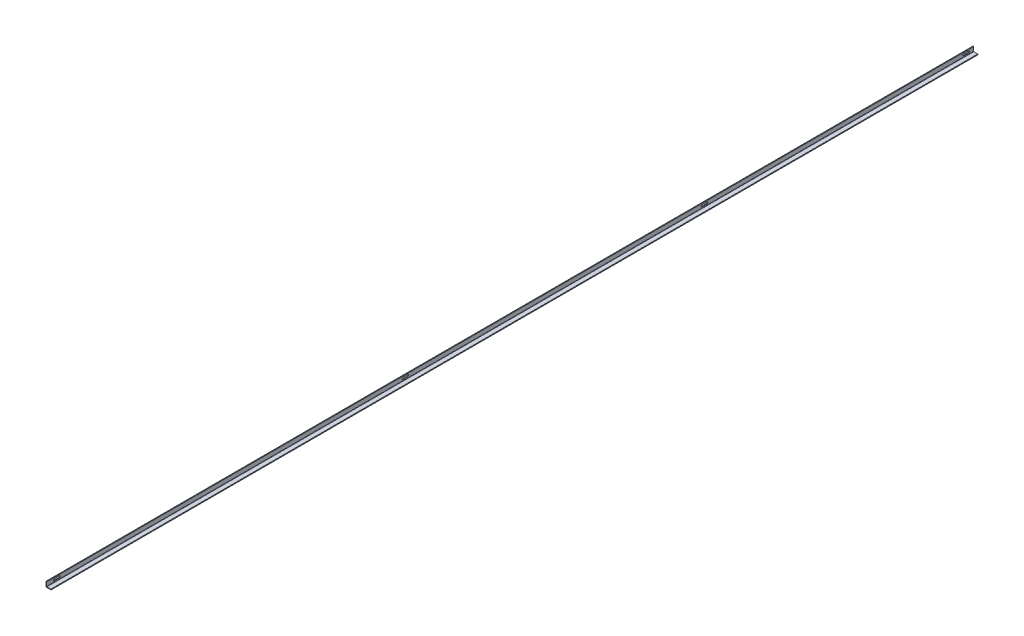
ISO-10303-21;
HEADER;
FILE_DESCRIPTION(('STEP AP214'),'2;1');
FILE_NAME('part.step','',(''),(''),'','','');
FILE_SCHEMA(('AUTOMOTIVE_DESIGN { 1 0 10303 214 1 1 1 1 }'));
ENDSEC;
DATA;
#1=APPLICATION_CONTEXT('core data for automotive mechanical design processes');
#2=APPLICATION_PROTOCOL_DEFINITION('international standard','automotive_design',2000,#1);
#3=PRODUCT_CONTEXT('',#1,'mechanical');
#4=PRODUCT('Part','Part','',(#3));
#5=PRODUCT_RELATED_PRODUCT_CATEGORY('part','',(#4));
#6=PRODUCT_DEFINITION_FORMATION('','',#4);
#7=PRODUCT_DEFINITION_CONTEXT('part definition',#1,'design');
#8=PRODUCT_DEFINITION('design','',#6,#7);
#9=PRODUCT_DEFINITION_SHAPE('','',#8);
#10=(LENGTH_UNIT() NAMED_UNIT(*) SI_UNIT(.MILLI.,.METRE.));
#11=(NAMED_UNIT(*) PLANE_ANGLE_UNIT() SI_UNIT($,.RADIAN.));
#12=(NAMED_UNIT(*) SI_UNIT($,.STERADIAN.) SOLID_ANGLE_UNIT());
#13=UNCERTAINTY_MEASURE_WITH_UNIT(LENGTH_MEASURE(1.E-05),#10,'distance_accuracy_value','');
#14=(GEOMETRIC_REPRESENTATION_CONTEXT(3) GLOBAL_UNCERTAINTY_ASSIGNED_CONTEXT((#13)) GLOBAL_UNIT_ASSIGNED_CONTEXT((#10,
#11,#12)) REPRESENTATION_CONTEXT('',''));
#15=CARTESIAN_POINT('',(0.,0.,0.));
#16=DIRECTION('',(0.,0.,1.));
#17=DIRECTION('',(1.,0.,0.));
#18=AXIS2_PLACEMENT_3D('',#15,#16,#17);
#19=CARTESIAN_POINT('',(3.175,0.,4660.9));
#20=DIRECTION('',(-1.,0.,0.));
#21=DIRECTION('',(0.,0.,1.));
#22=AXIS2_PLACEMENT_3D('',#19,#20,#21);
#23=PLANE('',#22);
#24=DIRECTION('',(0.,0.,1.));
#25=VECTOR('',#24,1.);
#26=CARTESIAN_POINT('',(3.175,9.9314,4597.4));
#27=LINE('',#26,#25);
#28=CARTESIAN_POINT('',(3.175,9.9314,4597.4));
#29=VERTEX_POINT('',#28);
#30=CARTESIAN_POINT('',(3.175,9.9314,4622.8));
#31=VERTEX_POINT('',#30);
#32=EDGE_CURVE('E200',#29,#31,#27,.T.);
#33=ORIENTED_EDGE('',*,*,#32,.T.);
#34=CARTESIAN_POINT('',(3.175,14.2875,4622.8));
#35=DIRECTION('',(1.,0.,0.));
#36=DIRECTION('',(0.,0.,-1.));
#37=AXIS2_PLACEMENT_3D('',#34,#35,#36);
#38=CIRCLE('',#37,4.3561);
#39=CARTESIAN_POINT('',(3.175,18.6436,4622.8));
#40=VERTEX_POINT('',#39);
#41=EDGE_CURVE('E47',#40,#31,#38,.T.);
#42=ORIENTED_EDGE('',*,*,#41,.F.);
#43=DIRECTION('',(0.,0.,-1.));
#44=VECTOR('',#43,1.);
#45=CARTESIAN_POINT('',(3.175,18.6436,4622.8));
#46=LINE('',#45,#44);
#47=CARTESIAN_POINT('',(3.175,18.6436,4597.4));
#48=VERTEX_POINT('',#47);
#49=EDGE_CURVE('E215',#40,#48,#46,.T.);
#50=ORIENTED_EDGE('',*,*,#49,.T.);
#51=CARTESIAN_POINT('',(3.175,14.2875,4597.4));
#52=DIRECTION('',(-1.,0.,0.));
#53=DIRECTION('',(0.,0.,1.));
#54=AXIS2_PLACEMENT_3D('',#51,#52,#53);
#55=CIRCLE('',#54,4.3561);
#56=EDGE_CURVE('E210',#48,#29,#55,.T.);
#57=ORIENTED_EDGE('',*,*,#56,.T.);
#58=EDGE_LOOP('',(#33,#42,#50,#57));
#59=FACE_BOUND('',#58,.T.);
#60=DIRECTION('',(0.,0.,1.));
#61=VECTOR('',#60,1.);
#62=CARTESIAN_POINT('',(3.175,9.9314,2844.8));
#63=LINE('',#62,#61);
#64=CARTESIAN_POINT('',(3.175,9.9314,2844.8));
#65=VERTEX_POINT('',#64);
#66=CARTESIAN_POINT('',(3.175,9.9314,2870.2));
#67=VERTEX_POINT('',#66);
#68=EDGE_CURVE('E232',#65,#67,#63,.T.);
#69=ORIENTED_EDGE('',*,*,#68,.T.);
#70=CARTESIAN_POINT('',(3.175,14.2875,2870.2));
#71=DIRECTION('',(1.,0.,0.));
#72=DIRECTION('',(0.,0.,-1.));
#73=AXIS2_PLACEMENT_3D('',#70,#71,#72);
#74=CIRCLE('',#73,4.3561);
#75=CARTESIAN_POINT('',(3.175,18.6436,2870.2));
#76=VERTEX_POINT('',#75);
#77=EDGE_CURVE('E260',#76,#67,#74,.T.);
#78=ORIENTED_EDGE('',*,*,#77,.F.);
#79=DIRECTION('',(0.,0.,-1.));
#80=VECTOR('',#79,1.);
#81=CARTESIAN_POINT('',(3.175,18.6436,2870.2));
#82=LINE('',#81,#80);
#83=CARTESIAN_POINT('',(3.175,18.6436,2844.8));
#84=VERTEX_POINT('',#83);
#85=EDGE_CURVE('E251',#76,#84,#82,.T.);
#86=ORIENTED_EDGE('',*,*,#85,.T.);
#87=CARTESIAN_POINT('',(3.175,14.2875,2844.8));
#88=DIRECTION('',(-1.,0.,0.));
#89=DIRECTION('',(0.,0.,1.));
#90=AXIS2_PLACEMENT_3D('',#87,#88,#89);
#91=CIRCLE('',#90,4.3561);
#92=EDGE_CURVE('E243',#84,#65,#91,.T.);
#93=ORIENTED_EDGE('',*,*,#92,.T.);
#94=EDGE_LOOP('',(#69,#78,#86,#93));
#95=FACE_BOUND('',#94,.T.);
#96=DIRECTION('',(0.,0.,1.));
#97=VECTOR('',#96,1.);
#98=CARTESIAN_POINT('',(3.175,9.9314,1339.85));
#99=LINE('',#98,#97);
#100=CARTESIAN_POINT('',(3.175,9.9314,1339.85));
#101=VERTEX_POINT('',#100);
#102=CARTESIAN_POINT('',(3.175,9.9314,1365.25));
#103=VERTEX_POINT('',#102);
#104=EDGE_CURVE('E265',#101,#103,#99,.T.);
#105=ORIENTED_EDGE('',*,*,#104,.T.);
#106=CARTESIAN_POINT('',(3.175,14.2875,1365.25));
#107=DIRECTION('',(1.,0.,0.));
#108=DIRECTION('',(0.,0.,-1.));
#109=AXIS2_PLACEMENT_3D('',#106,#107,#108);
#110=CIRCLE('',#109,4.3561);
#111=CARTESIAN_POINT('',(3.175,18.6436,1365.25));
#112=VERTEX_POINT('',#111);
#113=EDGE_CURVE('E293',#112,#103,#110,.T.);
#114=ORIENTED_EDGE('',*,*,#113,.F.);
#115=DIRECTION('',(0.,0.,-1.));
#116=VECTOR('',#115,1.);
#117=CARTESIAN_POINT('',(3.175,18.6436,1365.25));
#118=LINE('',#117,#116);
#119=CARTESIAN_POINT('',(3.175,18.6436,1339.85));
#120=VERTEX_POINT('',#119);
#121=EDGE_CURVE('E284',#112,#120,#118,.T.);
#122=ORIENTED_EDGE('',*,*,#121,.T.);
#123=CARTESIAN_POINT('',(3.175,14.2875,1339.85));
#124=DIRECTION('',(-1.,0.,0.));
#125=DIRECTION('',(0.,0.,1.));
#126=AXIS2_PLACEMENT_3D('',#123,#124,#125);
#127=CIRCLE('',#126,4.3561);
#128=EDGE_CURVE('E276',#120,#101,#127,.T.);
#129=ORIENTED_EDGE('',*,*,#128,.T.);
#130=EDGE_LOOP('',(#105,#114,#122,#129));
#131=FACE_BOUND('',#130,.T.);
#132=DIRECTION('',(0.,0.,1.));
#133=VECTOR('',#132,1.);
#134=CARTESIAN_POINT('',(3.175,9.9314,25.4000000000003));
#135=LINE('',#134,#133);
#136=CARTESIAN_POINT('',(3.175,9.9314,25.4000000000003));
#137=VERTEX_POINT('',#136);
#138=CARTESIAN_POINT('',(3.175,9.9314,50.7999999999997));
#139=VERTEX_POINT('',#138);
#140=EDGE_CURVE('E312',#137,#139,#135,.T.);
#141=ORIENTED_EDGE('',*,*,#140,.T.);
#142=CARTESIAN_POINT('',(3.175,14.2875,50.7999999999997));
#143=DIRECTION('',(1.,0.,0.));
#144=DIRECTION('',(0.,0.,-1.));
#145=AXIS2_PLACEMENT_3D('',#142,#143,#144);
#146=CIRCLE('',#145,4.3561);
#147=CARTESIAN_POINT('',(3.175,18.6436,50.7999999999997));
#148=VERTEX_POINT('',#147);
#149=EDGE_CURVE('E298',#148,#139,#146,.T.);
#150=ORIENTED_EDGE('',*,*,#149,.F.);
#151=DIRECTION('',(0.,0.,-1.));
#152=VECTOR('',#151,1.);
#153=CARTESIAN_POINT('',(3.175,18.6436,50.7999999999997));
#154=LINE('',#153,#152);
#155=CARTESIAN_POINT('',(3.175,18.6436,25.4000000000003));
#156=VERTEX_POINT('',#155);
#157=EDGE_CURVE('E303',#148,#156,#154,.T.);
#158=ORIENTED_EDGE('',*,*,#157,.T.);
#159=CARTESIAN_POINT('',(3.175,14.2875,25.4000000000003));
#160=DIRECTION('',(-1.,0.,0.));
#161=DIRECTION('',(0.,0.,1.));
#162=AXIS2_PLACEMENT_3D('',#159,#160,#161);
#163=CIRCLE('',#162,4.3561);
#164=EDGE_CURVE('E315',#156,#137,#163,.T.);
#165=ORIENTED_EDGE('',*,*,#164,.T.);
#166=EDGE_LOOP('',(#141,#150,#158,#165));
#167=FACE_BOUND('',#166,.T.);
#168=DIRECTION('',(0.,1.,0.));
#169=VECTOR('',#168,1.);
#170=CARTESIAN_POINT('',(3.175,0.,4660.9));
#171=LINE('',#170,#169);
#172=CARTESIAN_POINT('',(3.175,4.7625,4660.9));
#173=VERTEX_POINT('',#172);
#174=CARTESIAN_POINT('',(3.175,23.8125,4660.9));
#175=VERTEX_POINT('',#174);
#176=EDGE_CURVE('E329',#173,#175,#171,.T.);
#177=ORIENTED_EDGE('',*,*,#176,.F.);
#178=DIRECTION('',(0.,0.,-1.));
#179=VECTOR('',#178,1.);
#180=CARTESIAN_POINT('',(3.175,4.7625,0.));
#181=LINE('',#180,#179);
#182=CARTESIAN_POINT('',(3.175,4.7625,0.));
#183=VERTEX_POINT('',#182);
#184=EDGE_CURVE('E386',#173,#183,#181,.T.);
#185=ORIENTED_EDGE('',*,*,#184,.T.);
#186=DIRECTION('',(0.,1.,0.));
#187=VECTOR('',#186,1.);
#188=CARTESIAN_POINT('',(3.175,0.,0.));
#189=LINE('',#188,#187);
#190=CARTESIAN_POINT('',(3.175,23.8125,0.));
#191=VERTEX_POINT('',#190);
#192=EDGE_CURVE('E322',#183,#191,#189,.T.);
#193=ORIENTED_EDGE('',*,*,#192,.T.);
#194=DIRECTION('',(0.,0.,-1.));
#195=VECTOR('',#194,1.);
#196=CARTESIAN_POINT('',(3.175,23.8125,4660.9));
#197=LINE('',#196,#195);
#198=EDGE_CURVE('E384',#191,#175,#197,.F.);
#199=ORIENTED_EDGE('',*,*,#198,.T.);
#200=EDGE_LOOP('',(#177,#185,#193,#199));
#201=FACE_BOUND('',#200,.T.);
#202=ADVANCED_FACE('F32',(#59,#95,#131,#167,#201),#23,.F.);
#203=CARTESIAN_POINT('',(0.,25.4,4660.9));
#204=DIRECTION('',(0.,1.,0.));
#205=DIRECTION('',(0.,0.,1.));
#206=AXIS2_PLACEMENT_3D('',#203,#204,#205);
#207=PLANE('',#206);
#208=DIRECTION('',(1.,0.,0.));
#209=VECTOR('',#208,1.);
#210=CARTESIAN_POINT('',(0.,25.4,4660.9));
#211=LINE('',#210,#209);
#212=CARTESIAN_POINT('',(0.,25.4,4660.9));
#213=VERTEX_POINT('',#212);
#214=CARTESIAN_POINT('',(1.5875,25.4,4660.9));
#215=VERTEX_POINT('',#214);
#216=EDGE_CURVE('E332',#213,#215,#211,.T.);
#217=ORIENTED_EDGE('',*,*,#216,.T.);
#218=DIRECTION('',(0.,0.,-1.));
#219=VECTOR('',#218,1.);
#220=CARTESIAN_POINT('',(1.5875,25.4,0.));
#221=LINE('',#220,#219);
#222=CARTESIAN_POINT('',(1.5875,25.4,0.));
#223=VERTEX_POINT('',#222);
#224=EDGE_CURVE('E389',#215,#223,#221,.T.);
#225=ORIENTED_EDGE('',*,*,#224,.T.);
#226=DIRECTION('',(1.,0.,0.));
#227=VECTOR('',#226,1.);
#228=CARTESIAN_POINT('',(0.,25.4,0.));
#229=LINE('',#228,#227);
#230=CARTESIAN_POINT('',(0.,25.4,0.));
#231=VERTEX_POINT('',#230);
#232=EDGE_CURVE('E350',#231,#223,#229,.T.);
#233=ORIENTED_EDGE('',*,*,#232,.F.);
#234=DIRECTION('',(0.,0.,-1.));
#235=VECTOR('',#234,1.);
#236=CARTESIAN_POINT('',(0.,25.4,4660.9));
#237=LINE('',#236,#235);
#238=EDGE_CURVE('E367',#213,#231,#237,.T.);
#239=ORIENTED_EDGE('',*,*,#238,.F.);
#240=EDGE_LOOP('',(#217,#225,#233,#239));
#241=FACE_BOUND('',#240,.T.);
#242=ADVANCED_FACE('F416',(#241),#207,.T.);
#243=CARTESIAN_POINT('',(0.,0.,4660.9));
#244=DIRECTION('',(-1.,0.,0.));
#245=DIRECTION('',(0.,0.,1.));
#246=AXIS2_PLACEMENT_3D('',#243,#244,#245);
#247=PLANE('',#246);
#248=CARTESIAN_POINT('',(0.,14.2875,4622.8));
#249=DIRECTION('',(1.,0.,0.));
#250=DIRECTION('',(0.,0.,-1.));
#251=AXIS2_PLACEMENT_3D('',#248,#249,#250);
#252=CIRCLE('',#251,4.3561);
#253=CARTESIAN_POINT('',(0.,18.6436,4622.8));
#254=VERTEX_POINT('',#253);
#255=CARTESIAN_POINT('',(0.,9.9314,4622.8));
#256=VERTEX_POINT('',#255);
#257=EDGE_CURVE('E229',#254,#256,#252,.T.);
#258=ORIENTED_EDGE('',*,*,#257,.T.);
#259=DIRECTION('',(0.,0.,1.));
#260=VECTOR('',#259,1.);
#261=CARTESIAN_POINT('',(0.,9.9314,4597.4));
#262=LINE('',#261,#260);
#263=CARTESIAN_POINT('',(0.,9.9314,4597.4));
#264=VERTEX_POINT('',#263);
#265=EDGE_CURVE('E207',#264,#256,#262,.T.);
#266=ORIENTED_EDGE('',*,*,#265,.F.);
#267=CARTESIAN_POINT('',(0.,14.2875,4597.4));
#268=DIRECTION('',(-1.,0.,0.));
#269=DIRECTION('',(0.,0.,1.));
#270=AXIS2_PLACEMENT_3D('',#267,#268,#269);
#271=CIRCLE('',#270,4.3561);
#272=CARTESIAN_POINT('',(0.,18.6436,4597.4));
#273=VERTEX_POINT('',#272);
#274=EDGE_CURVE('E55',#273,#264,#271,.T.);
#275=ORIENTED_EDGE('',*,*,#274,.F.);
#276=DIRECTION('',(0.,0.,-1.));
#277=VECTOR('',#276,1.);
#278=CARTESIAN_POINT('',(0.,18.6436,4622.8));
#279=LINE('',#278,#277);
#280=EDGE_CURVE('E225',#254,#273,#279,.T.);
#281=ORIENTED_EDGE('',*,*,#280,.F.);
#282=EDGE_LOOP('',(#258,#266,#275,#281));
#283=FACE_BOUND('',#282,.T.);
#284=CARTESIAN_POINT('',(0.,14.2875,2870.2));
#285=DIRECTION('',(1.,0.,0.));
#286=DIRECTION('',(0.,0.,-1.));
#287=AXIS2_PLACEMENT_3D('',#284,#285,#286);
#288=CIRCLE('',#287,4.3561);
#289=CARTESIAN_POINT('',(0.,18.6436,2870.2));
#290=VERTEX_POINT('',#289);
#291=CARTESIAN_POINT('',(0.,9.9314,2870.2));
#292=VERTEX_POINT('',#291);
#293=EDGE_CURVE('E262',#290,#292,#288,.T.);
#294=ORIENTED_EDGE('',*,*,#293,.T.);
#295=DIRECTION('',(0.,0.,1.));
#296=VECTOR('',#295,1.);
#297=CARTESIAN_POINT('',(0.,9.9314,2844.8));
#298=LINE('',#297,#296);
#299=CARTESIAN_POINT('',(0.,9.9314,2844.8));
#300=VERTEX_POINT('',#299);
#301=EDGE_CURVE('E235',#300,#292,#298,.T.);
#302=ORIENTED_EDGE('',*,*,#301,.F.);
#303=CARTESIAN_POINT('',(0.,14.2875,2844.8));
#304=DIRECTION('',(-1.,0.,0.));
#305=DIRECTION('',(0.,0.,1.));
#306=AXIS2_PLACEMENT_3D('',#303,#304,#305);
#307=CIRCLE('',#306,4.3561);
#308=CARTESIAN_POINT('',(0.,18.6436,2844.8));
#309=VERTEX_POINT('',#308);
#310=EDGE_CURVE('E249',#309,#300,#307,.T.);
#311=ORIENTED_EDGE('',*,*,#310,.F.);
#312=DIRECTION('',(0.,0.,-1.));
#313=VECTOR('',#312,1.);
#314=CARTESIAN_POINT('',(0.,18.6436,2870.2));
#315=LINE('',#314,#313);
#316=EDGE_CURVE('E257',#290,#309,#315,.T.);
#317=ORIENTED_EDGE('',*,*,#316,.F.);
#318=EDGE_LOOP('',(#294,#302,#311,#317));
#319=FACE_BOUND('',#318,.T.);
#320=CARTESIAN_POINT('',(0.,14.2875,1365.25));
#321=DIRECTION('',(1.,0.,0.));
#322=DIRECTION('',(0.,0.,-1.));
#323=AXIS2_PLACEMENT_3D('',#320,#321,#322);
#324=CIRCLE('',#323,4.3561);
#325=CARTESIAN_POINT('',(0.,18.6436,1365.25));
#326=VERTEX_POINT('',#325);
#327=CARTESIAN_POINT('',(0.,9.9314,1365.25));
#328=VERTEX_POINT('',#327);
#329=EDGE_CURVE('E295',#326,#328,#324,.T.);
#330=ORIENTED_EDGE('',*,*,#329,.T.);
#331=DIRECTION('',(0.,0.,1.));
#332=VECTOR('',#331,1.);
#333=CARTESIAN_POINT('',(0.,9.9314,1339.85));
#334=LINE('',#333,#332);
#335=CARTESIAN_POINT('',(0.,9.9314,1339.85));
#336=VERTEX_POINT('',#335);
#337=EDGE_CURVE('E268',#336,#328,#334,.T.);
#338=ORIENTED_EDGE('',*,*,#337,.F.);
#339=CARTESIAN_POINT('',(0.,14.2875,1339.85));
#340=DIRECTION('',(-1.,0.,0.));
#341=DIRECTION('',(0.,0.,1.));
#342=AXIS2_PLACEMENT_3D('',#339,#340,#341);
#343=CIRCLE('',#342,4.3561);
#344=CARTESIAN_POINT('',(0.,18.6436,1339.85));
#345=VERTEX_POINT('',#344);
#346=EDGE_CURVE('E282',#345,#336,#343,.T.);
#347=ORIENTED_EDGE('',*,*,#346,.F.);
#348=DIRECTION('',(0.,0.,-1.));
#349=VECTOR('',#348,1.);
#350=CARTESIAN_POINT('',(0.,18.6436,1365.25));
#351=LINE('',#350,#349);
#352=EDGE_CURVE('E290',#326,#345,#351,.T.);
#353=ORIENTED_EDGE('',*,*,#352,.F.);
#354=EDGE_LOOP('',(#330,#338,#347,#353));
#355=FACE_BOUND('',#354,.T.);
#356=CARTESIAN_POINT('',(0.,14.2875,50.7999999999997));
#357=DIRECTION('',(1.,0.,0.));
#358=DIRECTION('',(0.,0.,-1.));
#359=AXIS2_PLACEMENT_3D('',#356,#357,#358);
#360=CIRCLE('',#359,4.3561);
#361=CARTESIAN_POINT('',(0.,18.6436,50.7999999999997));
#362=VERTEX_POINT('',#361);
#363=CARTESIAN_POINT('',(0.,9.9314,50.7999999999997));
#364=VERTEX_POINT('',#363);
#365=EDGE_CURVE('E299',#362,#364,#360,.T.);
#366=ORIENTED_EDGE('',*,*,#365,.T.);
#367=DIRECTION('',(0.,0.,1.));
#368=VECTOR('',#367,1.);
#369=CARTESIAN_POINT('',(0.,9.9314,25.4000000000003));
#370=LINE('',#369,#368);
#371=CARTESIAN_POINT('',(0.,9.9314,25.4000000000003));
#372=VERTEX_POINT('',#371);
#373=EDGE_CURVE('E302',#372,#364,#370,.T.);
#374=ORIENTED_EDGE('',*,*,#373,.F.);
#375=CARTESIAN_POINT('',(0.,14.2875,25.4000000000003));
#376=DIRECTION('',(-1.,0.,0.));
#377=DIRECTION('',(0.,0.,1.));
#378=AXIS2_PLACEMENT_3D('',#375,#376,#377);
#379=CIRCLE('',#378,4.3561);
#380=CARTESIAN_POINT('',(0.,18.6436,25.4000000000003));
#381=VERTEX_POINT('',#380);
#382=EDGE_CURVE('E305',#381,#372,#379,.T.);
#383=ORIENTED_EDGE('',*,*,#382,.F.);
#384=DIRECTION('',(0.,0.,-1.));
#385=VECTOR('',#384,1.);
#386=CARTESIAN_POINT('',(0.,18.6436,50.7999999999997));
#387=LINE('',#386,#385);
#388=EDGE_CURVE('E308',#362,#381,#387,.T.);
#389=ORIENTED_EDGE('',*,*,#388,.F.);
#390=EDGE_LOOP('',(#366,#374,#383,#389));
#391=FACE_BOUND('',#390,.T.);
#392=DIRECTION('',(0.,1.,0.));
#393=VECTOR('',#392,1.);
#394=CARTESIAN_POINT('',(0.,0.,0.));
#395=LINE('',#394,#393);
#396=CARTESIAN_POINT('',(0.,0.,0.));
#397=VERTEX_POINT('',#396);
#398=EDGE_CURVE('E353',#397,#231,#395,.T.);
#399=ORIENTED_EDGE('',*,*,#398,.F.);
#400=DIRECTION('',(0.,0.,-1.));
#401=VECTOR('',#400,1.);
#402=CARTESIAN_POINT('',(0.,0.,4660.9));
#403=LINE('',#402,#401);
#404=CARTESIAN_POINT('',(0.,0.,4660.9));
#405=VERTEX_POINT('',#404);
#406=EDGE_CURVE('E365',#405,#397,#403,.T.);
#407=ORIENTED_EDGE('',*,*,#406,.F.);
#408=DIRECTION('',(0.,1.,0.));
#409=VECTOR('',#408,1.);
#410=CARTESIAN_POINT('',(0.,0.,4660.9));
#411=LINE('',#410,#409);
#412=EDGE_CURVE('E336',#405,#213,#411,.T.);
#413=ORIENTED_EDGE('',*,*,#412,.T.);
#414=ORIENTED_EDGE('',*,*,#238,.T.);
#415=EDGE_LOOP('',(#399,#407,#413,#414));
#416=FACE_BOUND('',#415,.T.);
#417=ADVANCED_FACE('F420',(#283,#319,#355,#391,#416),#247,.T.);
#418=CARTESIAN_POINT('',(0.,0.,4660.9));
#419=DIRECTION('',(0.,-1.,0.));
#420=DIRECTION('',(0.,0.,-1.));
#421=AXIS2_PLACEMENT_3D('',#418,#419,#420);
#422=PLANE('',#421);
#423=DIRECTION('',(-1.,0.,0.));
#424=VECTOR('',#423,1.);
#425=CARTESIAN_POINT('',(0.,0.,0.));
#426=LINE('',#425,#424);
#427=CARTESIAN_POINT('',(25.4,0.,0.));
#428=VERTEX_POINT('',#427);
#429=EDGE_CURVE('E356',#428,#397,#426,.T.);
#430=ORIENTED_EDGE('',*,*,#429,.F.);
#431=DIRECTION('',(0.,0.,-1.));
#432=VECTOR('',#431,1.);
#433=CARTESIAN_POINT('',(25.4,0.,4660.9));
#434=LINE('',#433,#432);
#435=CARTESIAN_POINT('',(25.4,0.,4660.9));
#436=VERTEX_POINT('',#435);
#437=EDGE_CURVE('E347',#436,#428,#434,.T.);
#438=ORIENTED_EDGE('',*,*,#437,.F.);
#439=DIRECTION('',(-1.,0.,0.));
#440=VECTOR('',#439,1.);
#441=CARTESIAN_POINT('',(0.,0.,4660.9));
#442=LINE('',#441,#440);
#443=EDGE_CURVE('E339',#436,#405,#442,.T.);
#444=ORIENTED_EDGE('',*,*,#443,.T.);
#445=ORIENTED_EDGE('',*,*,#406,.T.);
#446=EDGE_LOOP('',(#430,#438,#444,#445));
#447=FACE_BOUND('',#446,.T.);
#448=ADVANCED_FACE('F425',(#447),#422,.T.);
#449=CARTESIAN_POINT('',(25.4,3.175,4660.9));
#450=DIRECTION('',(1.,0.,0.));
#451=DIRECTION('',(0.,0.,-1.));
#452=AXIS2_PLACEMENT_3D('',#449,#450,#451);
#453=PLANE('',#452);
#454=DIRECTION('',(0.,-1.,0.));
#455=VECTOR('',#454,1.);
#456=CARTESIAN_POINT('',(25.4,3.175,0.));
#457=LINE('',#456,#455);
#458=CARTESIAN_POINT('',(25.4,1.5875,0.));
#459=VERTEX_POINT('',#458);
#460=EDGE_CURVE('E359',#459,#428,#457,.T.);
#461=ORIENTED_EDGE('',*,*,#460,.F.);
#462=DIRECTION('',(0.,0.,-1.));
#463=VECTOR('',#462,1.);
#464=CARTESIAN_POINT('',(25.4,1.5875,4660.9));
#465=LINE('',#464,#463);
#466=CARTESIAN_POINT('',(25.4,1.5875,4660.9));
#467=VERTEX_POINT('',#466);
#468=EDGE_CURVE('E378',#459,#467,#465,.F.);
#469=ORIENTED_EDGE('',*,*,#468,.T.);
#470=DIRECTION('',(0.,-1.,0.));
#471=VECTOR('',#470,1.);
#472=CARTESIAN_POINT('',(25.4,3.175,4660.9));
#473=LINE('',#472,#471);
#474=EDGE_CURVE('E342',#467,#436,#473,.T.);
#475=ORIENTED_EDGE('',*,*,#474,.T.);
#476=ORIENTED_EDGE('',*,*,#437,.T.);
#477=EDGE_LOOP('',(#461,#469,#475,#476));
#478=FACE_BOUND('',#477,.T.);
#479=ADVANCED_FACE('F428',(#478),#453,.T.);
#480=CARTESIAN_POINT('',(0.,3.175,4660.9));
#481=DIRECTION('',(0.,-1.,0.));
#482=DIRECTION('',(0.,0.,-1.));
#483=AXIS2_PLACEMENT_3D('',#480,#481,#482);
#484=PLANE('',#483);
#485=DIRECTION('',(1.,0.,0.));
#486=VECTOR('',#485,1.);
#487=CARTESIAN_POINT('',(0.,3.175,4660.9));
#488=LINE('',#487,#486);
#489=CARTESIAN_POINT('',(23.8125,3.175,4660.9));
#490=VERTEX_POINT('',#489);
#491=CARTESIAN_POINT('',(4.7625,3.175,4660.9));
#492=VERTEX_POINT('',#491);
#493=EDGE_CURVE('E344',#490,#492,#488,.F.);
#494=ORIENTED_EDGE('',*,*,#493,.F.);
#495=DIRECTION('',(0.,0.,-1.));
#496=VECTOR('',#495,1.);
#497=CARTESIAN_POINT('',(23.8125,3.175,0.));
#498=LINE('',#497,#496);
#499=CARTESIAN_POINT('',(23.8125,3.175,0.));
#500=VERTEX_POINT('',#499);
#501=EDGE_CURVE('E371',#490,#500,#498,.T.);
#502=ORIENTED_EDGE('',*,*,#501,.T.);
#503=DIRECTION('',(1.,0.,0.));
#504=VECTOR('',#503,1.);
#505=CARTESIAN_POINT('',(0.,3.175,0.));
#506=LINE('',#505,#504);
#507=CARTESIAN_POINT('',(4.7625,3.175,0.));
#508=VERTEX_POINT('',#507);
#509=EDGE_CURVE('E333',#500,#508,#506,.F.);
#510=ORIENTED_EDGE('',*,*,#509,.T.);
#511=DIRECTION('',(0.,0.,-1.));
#512=VECTOR('',#511,1.);
#513=CARTESIAN_POINT('',(4.7625,3.175,4660.9));
#514=LINE('',#513,#512);
#515=EDGE_CURVE('E369',#508,#492,#514,.F.);
#516=ORIENTED_EDGE('',*,*,#515,.T.);
#517=EDGE_LOOP('',(#494,#502,#510,#516));
#518=FACE_BOUND('',#517,.T.);
#519=ADVANCED_FACE('F400',(#518),#484,.F.);
#520=CARTESIAN_POINT('',(3.175,25.4,4660.9));
#521=DIRECTION('',(0.,0.,-1.));
#522=DIRECTION('',(-1.,0.,0.));
#523=AXIS2_PLACEMENT_3D('',#520,#521,#522);
#524=PLANE('',#523);
#525=ORIENTED_EDGE('',*,*,#474,.F.);
#526=CARTESIAN_POINT('',(23.8125,1.5875,4660.9));
#527=DIRECTION('',(0.,0.,-1.));
#528=DIRECTION('',(-1.,0.,0.));
#529=AXIS2_PLACEMENT_3D('',#526,#527,#528);
#530=CIRCLE('',#529,1.5875);
#531=EDGE_CURVE('E382',#467,#490,#530,.F.);
#532=ORIENTED_EDGE('',*,*,#531,.T.);
#533=ORIENTED_EDGE('',*,*,#493,.T.);
#534=CARTESIAN_POINT('',(4.7625,4.7625,4660.9));
#535=DIRECTION('',(0.,0.,-1.));
#536=DIRECTION('',(-1.,0.,0.));
#537=AXIS2_PLACEMENT_3D('',#534,#535,#536);
#538=CIRCLE('',#537,1.5875);
#539=EDGE_CURVE('E11',#492,#173,#538,.T.);
#540=ORIENTED_EDGE('',*,*,#539,.T.);
#541=ORIENTED_EDGE('',*,*,#176,.T.);
#542=CARTESIAN_POINT('',(1.5875,23.8125,4660.9));
#543=DIRECTION('',(0.,0.,-1.));
#544=DIRECTION('',(-1.,0.,0.));
#545=AXIS2_PLACEMENT_3D('',#542,#543,#544);
#546=CIRCLE('',#545,1.5875);
#547=EDGE_CURVE('E380',#175,#215,#546,.F.);
#548=ORIENTED_EDGE('',*,*,#547,.T.);
#549=ORIENTED_EDGE('',*,*,#216,.F.);
#550=ORIENTED_EDGE('',*,*,#412,.F.);
#551=ORIENTED_EDGE('',*,*,#443,.F.);
#552=EDGE_LOOP('',(#525,#532,#533,#540,#541,#548,#549,#550,#551));
#553=FACE_BOUND('',#552,.T.);
#554=ADVANCED_FACE('F407',(#553),#524,.F.);
#555=CARTESIAN_POINT('',(3.175,25.4,0.));
#556=DIRECTION('',(0.,0.,-1.));
#557=DIRECTION('',(-1.,0.,0.));
#558=AXIS2_PLACEMENT_3D('',#555,#556,#557);
#559=PLANE('',#558);
#560=ORIENTED_EDGE('',*,*,#509,.F.);
#561=CARTESIAN_POINT('',(23.8125,1.5875,0.));
#562=DIRECTION('',(0.,0.,-1.));
#563=DIRECTION('',(-1.,0.,0.));
#564=AXIS2_PLACEMENT_3D('',#561,#562,#563);
#565=CIRCLE('',#564,1.5875);
#566=EDGE_CURVE('E376',#500,#459,#565,.T.);
#567=ORIENTED_EDGE('',*,*,#566,.T.);
#568=ORIENTED_EDGE('',*,*,#460,.T.);
#569=ORIENTED_EDGE('',*,*,#429,.T.);
#570=ORIENTED_EDGE('',*,*,#398,.T.);
#571=ORIENTED_EDGE('',*,*,#232,.T.);
#572=CARTESIAN_POINT('',(1.5875,23.8125,0.));
#573=DIRECTION('',(0.,0.,-1.));
#574=DIRECTION('',(-1.,0.,0.));
#575=AXIS2_PLACEMENT_3D('',#572,#573,#574);
#576=CIRCLE('',#575,1.5875);
#577=EDGE_CURVE('E374',#223,#191,#576,.T.);
#578=ORIENTED_EDGE('',*,*,#577,.T.);
#579=ORIENTED_EDGE('',*,*,#192,.F.);
#580=CARTESIAN_POINT('',(4.7625,4.7625,0.));
#581=DIRECTION('',(0.,0.,-1.));
#582=DIRECTION('',(-1.,0.,0.));
#583=AXIS2_PLACEMENT_3D('',#580,#581,#582);
#584=CIRCLE('',#583,1.5875);
#585=EDGE_CURVE('E40',#183,#508,#584,.F.);
#586=ORIENTED_EDGE('',*,*,#585,.T.);
#587=EDGE_LOOP('',(#560,#567,#568,#569,#570,#571,#578,#579,#586));
#588=FACE_BOUND('',#587,.T.);
#589=ADVANCED_FACE('F394',(#588),#559,.T.);
#590=CARTESIAN_POINT('',(23.8125,1.5875,4660.9));
#591=DIRECTION('',(0.,0.,1.));
#592=DIRECTION('',(1.,0.,0.));
#593=AXIS2_PLACEMENT_3D('',#590,#591,#592);
#594=CYLINDRICAL_SURFACE('',#593,1.5875);
#595=ORIENTED_EDGE('',*,*,#531,.F.);
#596=ORIENTED_EDGE('',*,*,#468,.F.);
#597=ORIENTED_EDGE('',*,*,#566,.F.);
#598=ORIENTED_EDGE('',*,*,#501,.F.);
#599=EDGE_LOOP('',(#595,#596,#597,#598));
#600=FACE_BOUND('',#599,.T.);
#601=ADVANCED_FACE('F432',(#600),#594,.T.);
#602=CARTESIAN_POINT('',(4.7625,4.7625,4660.9));
#603=DIRECTION('',(0.,0.,1.));
#604=DIRECTION('',(1.,0.,0.));
#605=AXIS2_PLACEMENT_3D('',#602,#603,#604);
#606=CYLINDRICAL_SURFACE('',#605,1.5875);
#607=ORIENTED_EDGE('',*,*,#539,.F.);
#608=ORIENTED_EDGE('',*,*,#515,.F.);
#609=ORIENTED_EDGE('',*,*,#585,.F.);
#610=ORIENTED_EDGE('',*,*,#184,.F.);
#611=EDGE_LOOP('',(#607,#608,#609,#610));
#612=FACE_BOUND('',#611,.T.);
#613=ADVANCED_FACE('F403',(#612),#606,.F.);
#614=CARTESIAN_POINT('',(1.5875,23.8125,4660.9));
#615=DIRECTION('',(0.,0.,1.));
#616=DIRECTION('',(1.,0.,0.));
#617=AXIS2_PLACEMENT_3D('',#614,#615,#616);
#618=CYLINDRICAL_SURFACE('',#617,1.5875);
#619=ORIENTED_EDGE('',*,*,#547,.F.);
#620=ORIENTED_EDGE('',*,*,#198,.F.);
#621=ORIENTED_EDGE('',*,*,#577,.F.);
#622=ORIENTED_EDGE('',*,*,#224,.F.);
#623=EDGE_LOOP('',(#619,#620,#621,#622));
#624=FACE_BOUND('',#623,.T.);
#625=ADVANCED_FACE('F34',(#624),#618,.T.);
#626=CARTESIAN_POINT('',(0.,14.2875,50.7999999999997));
#627=DIRECTION('',(1.,0.,0.));
#628=DIRECTION('',(0.,0.,-1.));
#629=AXIS2_PLACEMENT_3D('',#626,#627,#628);
#630=CYLINDRICAL_SURFACE('',#629,4.3561);
#631=ORIENTED_EDGE('',*,*,#149,.T.);
#632=DIRECTION('',(1.,0.,0.));
#633=VECTOR('',#632,1.);
#634=CARTESIAN_POINT('',(0.,9.9314,50.7999999999997));
#635=LINE('',#634,#633);
#636=EDGE_CURVE('E310',#364,#139,#635,.T.);
#637=ORIENTED_EDGE('',*,*,#636,.F.);
#638=ORIENTED_EDGE('',*,*,#365,.F.);
#639=DIRECTION('',(1.,0.,0.));
#640=VECTOR('',#639,1.);
#641=CARTESIAN_POINT('',(0.,18.6436,50.7999999999997));
#642=LINE('',#641,#640);
#643=EDGE_CURVE('E320',#362,#148,#642,.T.);
#644=ORIENTED_EDGE('',*,*,#643,.T.);
#645=EDGE_LOOP('',(#631,#637,#638,#644));
#646=FACE_BOUND('',#645,.T.);
#647=ADVANCED_FACE('F458',(#646),#630,.F.);
#648=CARTESIAN_POINT('',(0.,18.6436,50.7999999999997));
#649=DIRECTION('',(0.,-1.,0.));
#650=DIRECTION('',(0.,0.,-1.));
#651=AXIS2_PLACEMENT_3D('',#648,#649,#650);
#652=PLANE('',#651);
#653=ORIENTED_EDGE('',*,*,#157,.F.);
#654=ORIENTED_EDGE('',*,*,#643,.F.);
#655=ORIENTED_EDGE('',*,*,#388,.T.);
#656=DIRECTION('',(1.,0.,0.));
#657=VECTOR('',#656,1.);
#658=CARTESIAN_POINT('',(0.,18.6436,25.4000000000003));
#659=LINE('',#658,#657);
#660=EDGE_CURVE('E323',#381,#156,#659,.T.);
#661=ORIENTED_EDGE('',*,*,#660,.T.);
#662=EDGE_LOOP('',(#653,#654,#655,#661));
#663=FACE_BOUND('',#662,.T.);
#664=ADVANCED_FACE('F461',(#663),#652,.T.);
#665=CARTESIAN_POINT('',(0.,14.2875,25.4000000000003));
#666=DIRECTION('',(1.,0.,0.));
#667=DIRECTION('',(0.,0.,-1.));
#668=AXIS2_PLACEMENT_3D('',#665,#666,#667);
#669=CYLINDRICAL_SURFACE('',#668,4.3561);
#670=ORIENTED_EDGE('',*,*,#164,.F.);
#671=ORIENTED_EDGE('',*,*,#660,.F.);
#672=ORIENTED_EDGE('',*,*,#382,.T.);
#673=DIRECTION('',(1.,0.,0.));
#674=VECTOR('',#673,1.);
#675=CARTESIAN_POINT('',(0.,9.9314,25.4000000000003));
#676=LINE('',#675,#674);
#677=EDGE_CURVE('E325',#372,#137,#676,.T.);
#678=ORIENTED_EDGE('',*,*,#677,.T.);
#679=EDGE_LOOP('',(#670,#671,#672,#678));
#680=FACE_BOUND('',#679,.T.);
#681=ADVANCED_FACE('F467',(#680),#669,.F.);
#682=CARTESIAN_POINT('',(0.,9.9314,25.4000000000003));
#683=DIRECTION('',(0.,1.,0.));
#684=DIRECTION('',(0.,0.,1.));
#685=AXIS2_PLACEMENT_3D('',#682,#683,#684);
#686=PLANE('',#685);
#687=ORIENTED_EDGE('',*,*,#140,.F.);
#688=ORIENTED_EDGE('',*,*,#677,.F.);
#689=ORIENTED_EDGE('',*,*,#373,.T.);
#690=ORIENTED_EDGE('',*,*,#636,.T.);
#691=EDGE_LOOP('',(#687,#688,#689,#690));
#692=FACE_BOUND('',#691,.T.);
#693=ADVANCED_FACE('F463',(#692),#686,.T.);
#694=CARTESIAN_POINT('',(0.,14.2875,1365.25));
#695=DIRECTION('',(1.,0.,0.));
#696=DIRECTION('',(0.,0.,-1.));
#697=AXIS2_PLACEMENT_3D('',#694,#695,#696);
#698=CYLINDRICAL_SURFACE('',#697,4.3561);
#699=ORIENTED_EDGE('',*,*,#113,.T.);
#700=DIRECTION('',(1.,0.,0.));
#701=VECTOR('',#700,1.);
#702=CARTESIAN_POINT('',(0.,9.9314,1365.25));
#703=LINE('',#702,#701);
#704=EDGE_CURVE('E273',#328,#103,#703,.T.);
#705=ORIENTED_EDGE('',*,*,#704,.F.);
#706=ORIENTED_EDGE('',*,*,#329,.F.);
#707=DIRECTION('',(1.,0.,0.));
#708=VECTOR('',#707,1.);
#709=CARTESIAN_POINT('',(0.,18.6436,1365.25));
#710=LINE('',#709,#708);
#711=EDGE_CURVE('E287',#326,#112,#710,.T.);
#712=ORIENTED_EDGE('',*,*,#711,.T.);
#713=EDGE_LOOP('',(#699,#705,#706,#712));
#714=FACE_BOUND('',#713,.T.);
#715=ADVANCED_FACE('F466',(#714),#698,.F.);
#716=CARTESIAN_POINT('',(0.,18.6436,1365.25));
#717=DIRECTION('',(0.,-1.,0.));
#718=DIRECTION('',(0.,0.,-1.));
#719=AXIS2_PLACEMENT_3D('',#716,#717,#718);
#720=PLANE('',#719);
#721=ORIENTED_EDGE('',*,*,#121,.F.);
#722=ORIENTED_EDGE('',*,*,#711,.F.);
#723=ORIENTED_EDGE('',*,*,#352,.T.);
#724=DIRECTION('',(1.,0.,0.));
#725=VECTOR('',#724,1.);
#726=CARTESIAN_POINT('',(0.,18.6436,1339.85));
#727=LINE('',#726,#725);
#728=EDGE_CURVE('E279',#345,#120,#727,.T.);
#729=ORIENTED_EDGE('',*,*,#728,.T.);
#730=EDGE_LOOP('',(#721,#722,#723,#729));
#731=FACE_BOUND('',#730,.T.);
#732=ADVANCED_FACE('F478',(#731),#720,.T.);
#733=CARTESIAN_POINT('',(0.,14.2875,1339.85));
#734=DIRECTION('',(1.,0.,0.));
#735=DIRECTION('',(0.,0.,-1.));
#736=AXIS2_PLACEMENT_3D('',#733,#734,#735);
#737=CYLINDRICAL_SURFACE('',#736,4.3561);
#738=ORIENTED_EDGE('',*,*,#128,.F.);
#739=ORIENTED_EDGE('',*,*,#728,.F.);
#740=ORIENTED_EDGE('',*,*,#346,.T.);
#741=DIRECTION('',(1.,0.,0.));
#742=VECTOR('',#741,1.);
#743=CARTESIAN_POINT('',(0.,9.9314,1339.85));
#744=LINE('',#743,#742);
#745=EDGE_CURVE('E270',#336,#101,#744,.T.);
#746=ORIENTED_EDGE('',*,*,#745,.T.);
#747=EDGE_LOOP('',(#738,#739,#740,#746));
#748=FACE_BOUND('',#747,.T.);
#749=ADVANCED_FACE('F483',(#748),#737,.F.);
#750=CARTESIAN_POINT('',(0.,9.9314,1339.85));
#751=DIRECTION('',(0.,1.,0.));
#752=DIRECTION('',(0.,0.,1.));
#753=AXIS2_PLACEMENT_3D('',#750,#751,#752);
#754=PLANE('',#753);
#755=ORIENTED_EDGE('',*,*,#104,.F.);
#756=ORIENTED_EDGE('',*,*,#745,.F.);
#757=ORIENTED_EDGE('',*,*,#337,.T.);
#758=ORIENTED_EDGE('',*,*,#704,.T.);
#759=EDGE_LOOP('',(#755,#756,#757,#758));
#760=FACE_BOUND('',#759,.T.);
#761=ADVANCED_FACE('F469',(#760),#754,.T.);
#762=CARTESIAN_POINT('',(0.,14.2875,2870.2));
#763=DIRECTION('',(1.,0.,0.));
#764=DIRECTION('',(0.,0.,-1.));
#765=AXIS2_PLACEMENT_3D('',#762,#763,#764);
#766=CYLINDRICAL_SURFACE('',#765,4.3561);
#767=ORIENTED_EDGE('',*,*,#77,.T.);
#768=DIRECTION('',(1.,0.,0.));
#769=VECTOR('',#768,1.);
#770=CARTESIAN_POINT('',(0.,9.9314,2870.2));
#771=LINE('',#770,#769);
#772=EDGE_CURVE('E240',#292,#67,#771,.T.);
#773=ORIENTED_EDGE('',*,*,#772,.F.);
#774=ORIENTED_EDGE('',*,*,#293,.F.);
#775=DIRECTION('',(1.,0.,0.));
#776=VECTOR('',#775,1.);
#777=CARTESIAN_POINT('',(0.,18.6436,2870.2));
#778=LINE('',#777,#776);
#779=EDGE_CURVE('E254',#290,#76,#778,.T.);
#780=ORIENTED_EDGE('',*,*,#779,.T.);
#781=EDGE_LOOP('',(#767,#773,#774,#780));
#782=FACE_BOUND('',#781,.T.);
#783=ADVANCED_FACE('F490',(#782),#766,.F.);
#784=CARTESIAN_POINT('',(0.,18.6436,2870.2));
#785=DIRECTION('',(0.,-1.,0.));
#786=DIRECTION('',(0.,0.,-1.));
#787=AXIS2_PLACEMENT_3D('',#784,#785,#786);
#788=PLANE('',#787);
#789=ORIENTED_EDGE('',*,*,#85,.F.);
#790=ORIENTED_EDGE('',*,*,#779,.F.);
#791=ORIENTED_EDGE('',*,*,#316,.T.);
#792=DIRECTION('',(1.,0.,0.));
#793=VECTOR('',#792,1.);
#794=CARTESIAN_POINT('',(0.,18.6436,2844.8));
#795=LINE('',#794,#793);
#796=EDGE_CURVE('E246',#309,#84,#795,.T.);
#797=ORIENTED_EDGE('',*,*,#796,.T.);
#798=EDGE_LOOP('',(#789,#790,#791,#797));
#799=FACE_BOUND('',#798,.T.);
#800=ADVANCED_FACE('F494',(#799),#788,.T.);
#801=CARTESIAN_POINT('',(0.,14.2875,2844.8));
#802=DIRECTION('',(1.,0.,0.));
#803=DIRECTION('',(0.,0.,-1.));
#804=AXIS2_PLACEMENT_3D('',#801,#802,#803);
#805=CYLINDRICAL_SURFACE('',#804,4.3561);
#806=ORIENTED_EDGE('',*,*,#92,.F.);
#807=ORIENTED_EDGE('',*,*,#796,.F.);
#808=ORIENTED_EDGE('',*,*,#310,.T.);
#809=DIRECTION('',(1.,0.,0.));
#810=VECTOR('',#809,1.);
#811=CARTESIAN_POINT('',(0.,9.9314,2844.8));
#812=LINE('',#811,#810);
#813=EDGE_CURVE('E237',#300,#65,#812,.T.);
#814=ORIENTED_EDGE('',*,*,#813,.T.);
#815=EDGE_LOOP('',(#806,#807,#808,#814));
#816=FACE_BOUND('',#815,.T.);
#817=ADVANCED_FACE('F498',(#816),#805,.F.);
#818=CARTESIAN_POINT('',(0.,9.9314,2844.8));
#819=DIRECTION('',(0.,1.,0.));
#820=DIRECTION('',(0.,0.,1.));
#821=AXIS2_PLACEMENT_3D('',#818,#819,#820);
#822=PLANE('',#821);
#823=ORIENTED_EDGE('',*,*,#68,.F.);
#824=ORIENTED_EDGE('',*,*,#813,.F.);
#825=ORIENTED_EDGE('',*,*,#301,.T.);
#826=ORIENTED_EDGE('',*,*,#772,.T.);
#827=EDGE_LOOP('',(#823,#824,#825,#826));
#828=FACE_BOUND('',#827,.T.);
#829=ADVANCED_FACE('F480',(#828),#822,.T.);
#830=CARTESIAN_POINT('',(0.,14.2875,4622.8));
#831=DIRECTION('',(1.,0.,0.));
#832=DIRECTION('',(0.,0.,-1.));
#833=AXIS2_PLACEMENT_3D('',#830,#831,#832);
#834=CYLINDRICAL_SURFACE('',#833,4.3561);
#835=ORIENTED_EDGE('',*,*,#41,.T.);
#836=DIRECTION('',(1.,0.,0.));
#837=VECTOR('',#836,1.);
#838=CARTESIAN_POINT('',(0.,9.9314,4622.8));
#839=LINE('',#838,#837);
#840=EDGE_CURVE('E204',#256,#31,#839,.T.);
#841=ORIENTED_EDGE('',*,*,#840,.F.);
#842=ORIENTED_EDGE('',*,*,#257,.F.);
#843=DIRECTION('',(1.,0.,0.));
#844=VECTOR('',#843,1.);
#845=CARTESIAN_POINT('',(0.,18.6436,4622.8));
#846=LINE('',#845,#844);
#847=EDGE_CURVE('E223',#254,#40,#846,.T.);
#848=ORIENTED_EDGE('',*,*,#847,.T.);
#849=EDGE_LOOP('',(#835,#841,#842,#848));
#850=FACE_BOUND('',#849,.T.);
#851=ADVANCED_FACE('F505',(#850),#834,.F.);
#852=CARTESIAN_POINT('',(0.,18.6436,4622.8));
#853=DIRECTION('',(0.,-1.,0.));
#854=DIRECTION('',(0.,0.,-1.));
#855=AXIS2_PLACEMENT_3D('',#852,#853,#854);
#856=PLANE('',#855);
#857=ORIENTED_EDGE('',*,*,#49,.F.);
#858=ORIENTED_EDGE('',*,*,#847,.F.);
#859=ORIENTED_EDGE('',*,*,#280,.T.);
#860=DIRECTION('',(1.,0.,0.));
#861=VECTOR('',#860,1.);
#862=CARTESIAN_POINT('',(0.,18.6436,4597.4));
#863=LINE('',#862,#861);
#864=EDGE_CURVE('E216',#273,#48,#863,.T.);
#865=ORIENTED_EDGE('',*,*,#864,.T.);
#866=EDGE_LOOP('',(#857,#858,#859,#865));
#867=FACE_BOUND('',#866,.T.);
#868=ADVANCED_FACE('F509',(#867),#856,.T.);
#869=CARTESIAN_POINT('',(0.,14.2875,4597.4));
#870=DIRECTION('',(1.,0.,0.));
#871=DIRECTION('',(0.,0.,-1.));
#872=AXIS2_PLACEMENT_3D('',#869,#870,#871);
#873=CYLINDRICAL_SURFACE('',#872,4.3561);
#874=ORIENTED_EDGE('',*,*,#56,.F.);
#875=ORIENTED_EDGE('',*,*,#864,.F.);
#876=ORIENTED_EDGE('',*,*,#274,.T.);
#877=DIRECTION('',(1.,0.,0.));
#878=VECTOR('',#877,1.);
#879=CARTESIAN_POINT('',(0.,9.9314,4597.4));
#880=LINE('',#879,#878);
#881=EDGE_CURVE('E202',#264,#29,#880,.T.);
#882=ORIENTED_EDGE('',*,*,#881,.T.);
#883=EDGE_LOOP('',(#874,#875,#876,#882));
#884=FACE_BOUND('',#883,.T.);
#885=ADVANCED_FACE('F209',(#884),#873,.F.);
#886=CARTESIAN_POINT('',(0.,9.9314,4597.4));
#887=DIRECTION('',(0.,1.,0.));
#888=DIRECTION('',(0.,0.,1.));
#889=AXIS2_PLACEMENT_3D('',#886,#887,#888);
#890=PLANE('',#889);
#891=ORIENTED_EDGE('',*,*,#32,.F.);
#892=ORIENTED_EDGE('',*,*,#881,.F.);
#893=ORIENTED_EDGE('',*,*,#265,.T.);
#894=ORIENTED_EDGE('',*,*,#840,.T.);
#895=EDGE_LOOP('',(#891,#892,#893,#894));
#896=FACE_BOUND('',#895,.T.);
#897=ADVANCED_FACE('F201',(#896),#890,.T.);
#898=CLOSED_SHELL('',(#202,#242,#417,#448,#479,#519,#554,#589,#601,#613,#625,#647,#664,#681,
#693,#715,#732,#749,#761,#783,#800,#817,#829,#851,#868,#885,#897));
#899=MANIFOLD_SOLID_BREP('B2',#898);
#900=ADVANCED_BREP_SHAPE_REPRESENTATION('',(#18,#899),#14);
#901=SHAPE_DEFINITION_REPRESENTATION(#9,#900);
ENDSEC;
END-ISO-10303-21;
